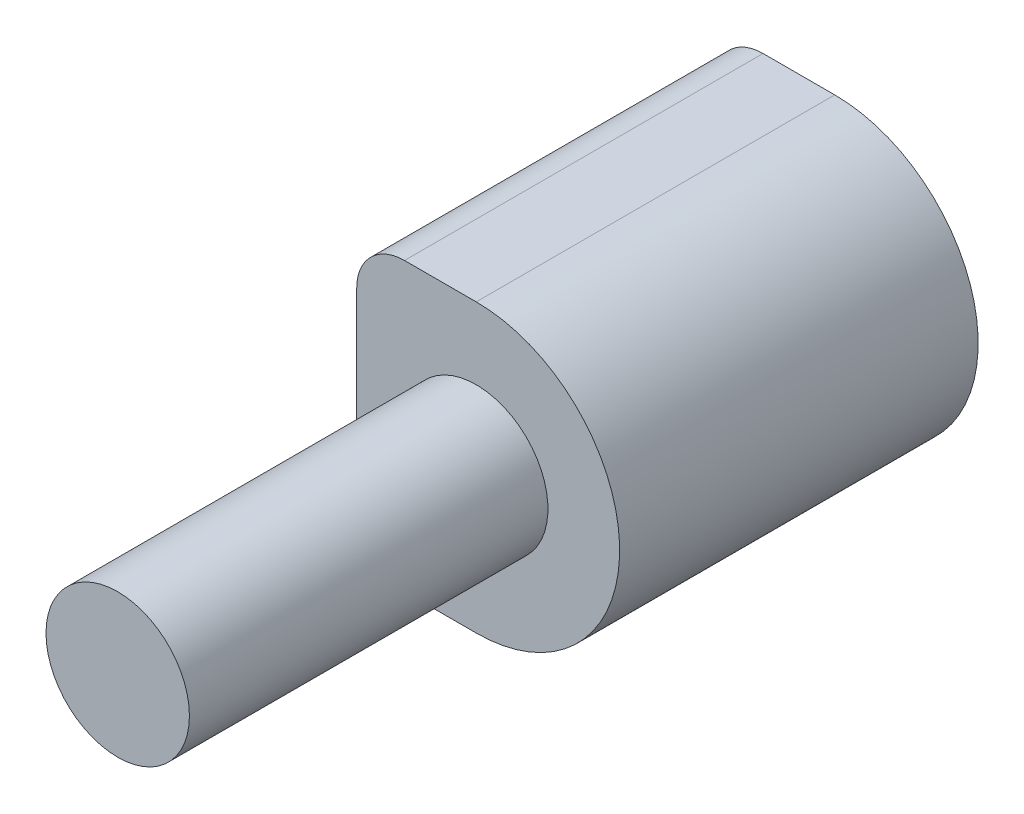
ISO-10303-21;
HEADER;
FILE_DESCRIPTION(('STEP AP214'),'2;1');
FILE_NAME('part.step','',(''),(''),'','','');
FILE_SCHEMA(('AUTOMOTIVE_DESIGN { 1 0 10303 214 1 1 1 1 }'));
ENDSEC;
DATA;
#1=APPLICATION_CONTEXT('core data for automotive mechanical design processes');
#2=APPLICATION_PROTOCOL_DEFINITION('international standard','automotive_design',2000,#1);
#3=PRODUCT_CONTEXT('',#1,'mechanical');
#4=PRODUCT('Part','Part','',(#3));
#5=PRODUCT_RELATED_PRODUCT_CATEGORY('part','',(#4));
#6=PRODUCT_DEFINITION_FORMATION('','',#4);
#7=PRODUCT_DEFINITION_CONTEXT('part definition',#1,'design');
#8=PRODUCT_DEFINITION('design','',#6,#7);
#9=PRODUCT_DEFINITION_SHAPE('','',#8);
#10=(LENGTH_UNIT() NAMED_UNIT(*) SI_UNIT(.MILLI.,.METRE.));
#11=(NAMED_UNIT(*) PLANE_ANGLE_UNIT() SI_UNIT($,.RADIAN.));
#12=(NAMED_UNIT(*) SI_UNIT($,.STERADIAN.) SOLID_ANGLE_UNIT());
#13=UNCERTAINTY_MEASURE_WITH_UNIT(LENGTH_MEASURE(1.E-05),#10,'distance_accuracy_value','');
#14=(GEOMETRIC_REPRESENTATION_CONTEXT(3) GLOBAL_UNCERTAINTY_ASSIGNED_CONTEXT((#13)) GLOBAL_UNIT_ASSIGNED_CONTEXT((#10,
#11,#12)) REPRESENTATION_CONTEXT('',''));
#15=CARTESIAN_POINT('',(0.,0.,0.));
#16=DIRECTION('',(0.,0.,1.));
#17=DIRECTION('',(1.,0.,0.));
#18=AXIS2_PLACEMENT_3D('',#15,#16,#17);
#19=CARTESIAN_POINT('',(15.,3.,30.));
#20=DIRECTION('',(0.,0.,1.));
#21=DIRECTION('',(1.,0.,0.));
#22=AXIS2_PLACEMENT_3D('',#19,#20,#21);
#23=PLANE('',#22);
#24=CARTESIAN_POINT('',(15.,3.,30.));
#25=DIRECTION('',(0.,0.,1.));
#26=DIRECTION('',(1.,0.,0.));
#27=AXIS2_PLACEMENT_3D('',#24,#25,#26);
#28=CIRCLE('',#27,3.);
#29=CARTESIAN_POINT('',(18.,3.,30.));
#30=VERTEX_POINT('',#29);
#31=EDGE_CURVE('E144',#30,#30,#28,.T.);
#32=ORIENTED_EDGE('',*,*,#31,.T.);
#33=EDGE_LOOP('',(#32));
#34=FACE_BOUND('',#33,.T.);
#35=ADVANCED_FACE('F34',(#34),#23,.T.);
#36=CARTESIAN_POINT('',(19.,0.,0.));
#37=DIRECTION('',(-1.,0.,0.));
#38=DIRECTION('',(0.,0.,1.));
#39=AXIS2_PLACEMENT_3D('',#36,#37,#38);
#40=PLANE('',#39);
#41=DIRECTION('',(0.,1.,0.));
#42=VECTOR('',#41,1.);
#43=CARTESIAN_POINT('',(19.,5.,13.5));
#44=LINE('',#43,#42);
#45=CARTESIAN_POINT('',(19.,1.,13.5));
#46=VERTEX_POINT('',#45);
#47=CARTESIAN_POINT('',(19.,5.,13.5));
#48=VERTEX_POINT('',#47);
#49=EDGE_CURVE('E111',#46,#48,#44,.T.);
#50=ORIENTED_EDGE('',*,*,#49,.T.);
#51=DIRECTION('',(0.,0.,-1.));
#52=VECTOR('',#51,1.);
#53=CARTESIAN_POINT('',(19.,5.,1.5));
#54=LINE('',#53,#52);
#55=CARTESIAN_POINT('',(19.,5.,1.5));
#56=VERTEX_POINT('',#55);
#57=EDGE_CURVE('E120',#48,#56,#54,.T.);
#58=ORIENTED_EDGE('',*,*,#57,.T.);
#59=DIRECTION('',(0.,-1.,0.));
#60=VECTOR('',#59,1.);
#61=CARTESIAN_POINT('',(19.,5.,1.5));
#62=LINE('',#61,#60);
#63=CARTESIAN_POINT('',(19.,1.,1.5));
#64=VERTEX_POINT('',#63);
#65=EDGE_CURVE('E125',#56,#64,#62,.T.);
#66=ORIENTED_EDGE('',*,*,#65,.T.);
#67=DIRECTION('',(0.,0.,1.));
#68=VECTOR('',#67,1.);
#69=CARTESIAN_POINT('',(19.,1.,1.5));
#70=LINE('',#69,#68);
#71=EDGE_CURVE('E117',#64,#46,#70,.T.);
#72=ORIENTED_EDGE('',*,*,#71,.T.);
#73=EDGE_LOOP('',(#50,#58,#66,#72));
#74=FACE_BOUND('',#73,.T.);
#75=ADVANCED_FACE('F127',(#74),#40,.T.);
#76=CARTESIAN_POINT('',(15.,3.,30.));
#77=DIRECTION('',(0.,0.,-1.));
#78=DIRECTION('',(-1.,0.,0.));
#79=AXIS2_PLACEMENT_3D('',#76,#77,#78);
#80=CYLINDRICAL_SURFACE('',#79,3.);
#81=ORIENTED_EDGE('',*,*,#31,.F.);
#82=EDGE_LOOP('',(#81));
#83=FACE_BOUND('',#82,.T.);
#84=CARTESIAN_POINT('',(15.,3.,15.));
#85=DIRECTION('',(0.,0.,-1.));
#86=DIRECTION('',(-1.,0.,0.));
#87=AXIS2_PLACEMENT_3D('',#84,#85,#86);
#88=CIRCLE('',#87,3.);
#89=CARTESIAN_POINT('',(12.,3.,15.));
#90=VERTEX_POINT('',#89);
#91=EDGE_CURVE('E175',#90,#90,#88,.F.);
#92=ORIENTED_EDGE('',*,*,#91,.T.);
#93=EDGE_LOOP('',(#92));
#94=FACE_BOUND('',#93,.T.);
#95=ADVANCED_FACE('F251',(#83,#94),#80,.T.);
#96=CARTESIAN_POINT('',(19.,5.,1.5));
#97=DIRECTION('',(0.,0.,-1.));
#98=DIRECTION('',(-1.,0.,0.));
#99=AXIS2_PLACEMENT_3D('',#96,#97,#98);
#100=PLANE('',#99);
#101=DIRECTION('',(0.,-1.,0.));
#102=VECTOR('',#101,1.);
#103=CARTESIAN_POINT('',(10.,5.,1.5));
#104=LINE('',#103,#102);
#105=CARTESIAN_POINT('',(10.,5.,1.5));
#106=VERTEX_POINT('',#105);
#107=CARTESIAN_POINT('',(10.,1.,1.5));
#108=VERTEX_POINT('',#107);
#109=EDGE_CURVE('E132',#106,#108,#104,.T.);
#110=ORIENTED_EDGE('',*,*,#109,.T.);
#111=DIRECTION('',(-1.,0.,0.));
#112=VECTOR('',#111,1.);
#113=CARTESIAN_POINT('',(19.,1.,1.5));
#114=LINE('',#113,#112);
#115=EDGE_CURVE('E145',#64,#108,#114,.T.);
#116=ORIENTED_EDGE('',*,*,#115,.F.);
#117=ORIENTED_EDGE('',*,*,#65,.F.);
#118=DIRECTION('',(-1.,0.,0.));
#119=VECTOR('',#118,1.);
#120=CARTESIAN_POINT('',(19.,5.,1.5));
#121=LINE('',#120,#119);
#122=EDGE_CURVE('E116',#56,#106,#121,.T.);
#123=ORIENTED_EDGE('',*,*,#122,.T.);
#124=EDGE_LOOP('',(#110,#116,#117,#123));
#125=FACE_BOUND('',#124,.T.);
#126=ADVANCED_FACE('F254',(#125),#100,.F.);
#127=CARTESIAN_POINT('',(19.,1.,1.5));
#128=DIRECTION('',(0.,-1.,0.));
#129=DIRECTION('',(0.,0.,-1.));
#130=AXIS2_PLACEMENT_3D('',#127,#128,#129);
#131=PLANE('',#130);
#132=DIRECTION('',(0.,0.,1.));
#133=VECTOR('',#132,1.);
#134=CARTESIAN_POINT('',(10.,1.,1.5));
#135=LINE('',#134,#133);
#136=CARTESIAN_POINT('',(10.,1.,13.5));
#137=VERTEX_POINT('',#136);
#138=EDGE_CURVE('E129',#108,#137,#135,.T.);
#139=ORIENTED_EDGE('',*,*,#138,.T.);
#140=DIRECTION('',(-1.,0.,0.));
#141=VECTOR('',#140,1.);
#142=CARTESIAN_POINT('',(19.,1.,13.5));
#143=LINE('',#142,#141);
#144=EDGE_CURVE('E142',#46,#137,#143,.T.);
#145=ORIENTED_EDGE('',*,*,#144,.F.);
#146=ORIENTED_EDGE('',*,*,#71,.F.);
#147=ORIENTED_EDGE('',*,*,#115,.T.);
#148=EDGE_LOOP('',(#139,#145,#146,#147));
#149=FACE_BOUND('',#148,.T.);
#150=ADVANCED_FACE('F261',(#149),#131,.F.);
#151=CARTESIAN_POINT('',(19.,5.,13.5));
#152=DIRECTION('',(0.,0.,1.));
#153=DIRECTION('',(1.,0.,0.));
#154=AXIS2_PLACEMENT_3D('',#151,#152,#153);
#155=PLANE('',#154);
#156=DIRECTION('',(0.,1.,0.));
#157=VECTOR('',#156,1.);
#158=CARTESIAN_POINT('',(10.,5.,13.5));
#159=LINE('',#158,#157);
#160=CARTESIAN_POINT('',(10.,5.,13.5));
#161=VERTEX_POINT('',#160);
#162=EDGE_CURVE('E49',#137,#161,#159,.T.);
#163=ORIENTED_EDGE('',*,*,#162,.T.);
#164=DIRECTION('',(-1.,0.,0.));
#165=VECTOR('',#164,1.);
#166=CARTESIAN_POINT('',(19.,5.,13.5));
#167=LINE('',#166,#165);
#168=EDGE_CURVE('E107',#48,#161,#167,.T.);
#169=ORIENTED_EDGE('',*,*,#168,.F.);
#170=ORIENTED_EDGE('',*,*,#49,.F.);
#171=ORIENTED_EDGE('',*,*,#144,.T.);
#172=EDGE_LOOP('',(#163,#169,#170,#171));
#173=FACE_BOUND('',#172,.T.);
#174=ADVANCED_FACE('F109',(#173),#155,.F.);
#175=CARTESIAN_POINT('',(19.,5.,1.5));
#176=DIRECTION('',(0.,1.,0.));
#177=DIRECTION('',(0.,0.,1.));
#178=AXIS2_PLACEMENT_3D('',#175,#176,#177);
#179=PLANE('',#178);
#180=DIRECTION('',(0.,0.,-1.));
#181=VECTOR('',#180,1.);
#182=CARTESIAN_POINT('',(10.,5.,1.5));
#183=LINE('',#182,#181);
#184=EDGE_CURVE('E138',#161,#106,#183,.T.);
#185=ORIENTED_EDGE('',*,*,#184,.T.);
#186=ORIENTED_EDGE('',*,*,#122,.F.);
#187=ORIENTED_EDGE('',*,*,#57,.F.);
#188=ORIENTED_EDGE('',*,*,#168,.T.);
#189=EDGE_LOOP('',(#185,#186,#187,#188));
#190=FACE_BOUND('',#189,.T.);
#191=ADVANCED_FACE('F121',(#190),#179,.F.);
#192=CARTESIAN_POINT('',(10.,-3.,15.));
#193=DIRECTION('',(0.,1.,0.));
#194=DIRECTION('',(-1.,0.,0.));
#195=AXIS2_PLACEMENT_3D('',#192,#193,#194);
#196=PLANE('',#195);
#197=DIRECTION('',(1.,0.,0.));
#198=VECTOR('',#197,1.);
#199=CARTESIAN_POINT('',(10.,-3.,15.));
#200=LINE('',#199,#198);
#201=CARTESIAN_POINT('',(12.,-3.,15.));
#202=VERTEX_POINT('',#201);
#203=CARTESIAN_POINT('',(15.,-3.,15.));
#204=VERTEX_POINT('',#203);
#205=EDGE_CURVE('E157',#202,#204,#200,.T.);
#206=ORIENTED_EDGE('',*,*,#205,.F.);
#207=DIRECTION('',(0.,0.,-1.));
#208=VECTOR('',#207,1.);
#209=CARTESIAN_POINT('',(12.,-3.,15.));
#210=LINE('',#209,#208);
#211=CARTESIAN_POINT('',(12.,-3.,0.));
#212=VERTEX_POINT('',#211);
#213=EDGE_CURVE('E184',#202,#212,#210,.T.);
#214=ORIENTED_EDGE('',*,*,#213,.T.);
#215=DIRECTION('',(1.,0.,0.));
#216=VECTOR('',#215,1.);
#217=CARTESIAN_POINT('',(10.,-3.,0.));
#218=LINE('',#217,#216);
#219=CARTESIAN_POINT('',(15.,-3.,0.));
#220=VERTEX_POINT('',#219);
#221=EDGE_CURVE('E167',#212,#220,#218,.T.);
#222=ORIENTED_EDGE('',*,*,#221,.T.);
#223=DIRECTION('',(0.,0.,-1.));
#224=VECTOR('',#223,1.);
#225=CARTESIAN_POINT('',(15.,-3.,15.));
#226=LINE('',#225,#224);
#227=EDGE_CURVE('E178',#204,#220,#226,.T.);
#228=ORIENTED_EDGE('',*,*,#227,.F.);
#229=EDGE_LOOP('',(#206,#214,#222,#228));
#230=FACE_BOUND('',#229,.T.);
#231=ADVANCED_FACE('F199',(#230),#196,.F.);
#232=CARTESIAN_POINT('',(10.,9.,15.));
#233=DIRECTION('',(1.,0.,0.));
#234=DIRECTION('',(0.,0.,-1.));
#235=AXIS2_PLACEMENT_3D('',#232,#233,#234);
#236=PLANE('',#235);
#237=ORIENTED_EDGE('',*,*,#184,.F.);
#238=ORIENTED_EDGE('',*,*,#162,.F.);
#239=ORIENTED_EDGE('',*,*,#138,.F.);
#240=ORIENTED_EDGE('',*,*,#109,.F.);
#241=EDGE_LOOP('',(#237,#238,#239,#240));
#242=FACE_BOUND('',#241,.T.);
#243=DIRECTION('',(0.,-1.,0.));
#244=VECTOR('',#243,1.);
#245=CARTESIAN_POINT('',(10.,9.,0.));
#246=LINE('',#245,#244);
#247=CARTESIAN_POINT('',(10.,7.,0.));
#248=VERTEX_POINT('',#247);
#249=CARTESIAN_POINT('',(10.,-0.999999999999999,0.));
#250=VERTEX_POINT('',#249);
#251=EDGE_CURVE('E154',#248,#250,#246,.T.);
#252=ORIENTED_EDGE('',*,*,#251,.T.);
#253=DIRECTION('',(0.,0.,-1.));
#254=VECTOR('',#253,1.);
#255=CARTESIAN_POINT('',(10.,-0.999999999999999,15.));
#256=LINE('',#255,#254);
#257=CARTESIAN_POINT('',(10.,-0.999999999999999,15.));
#258=VERTEX_POINT('',#257);
#259=EDGE_CURVE('E209',#250,#258,#256,.F.);
#260=ORIENTED_EDGE('',*,*,#259,.T.);
#261=DIRECTION('',(0.,-1.,0.));
#262=VECTOR('',#261,1.);
#263=CARTESIAN_POINT('',(10.,9.,15.));
#264=LINE('',#263,#262);
#265=CARTESIAN_POINT('',(10.,7.,15.));
#266=VERTEX_POINT('',#265);
#267=EDGE_CURVE('E159',#266,#258,#264,.T.);
#268=ORIENTED_EDGE('',*,*,#267,.F.);
#269=DIRECTION('',(0.,0.,-1.));
#270=VECTOR('',#269,1.);
#271=CARTESIAN_POINT('',(10.,7.,0.));
#272=LINE('',#271,#270);
#273=EDGE_CURVE('E204',#266,#248,#272,.T.);
#274=ORIENTED_EDGE('',*,*,#273,.T.);
#275=EDGE_LOOP('',(#252,#260,#268,#274));
#276=FACE_BOUND('',#275,.T.);
#277=ADVANCED_FACE('F222',(#242,#276),#236,.F.);
#278=CARTESIAN_POINT('',(10.,9.,15.));
#279=DIRECTION('',(0.,1.,0.));
#280=DIRECTION('',(-1.,0.,0.));
#281=AXIS2_PLACEMENT_3D('',#278,#279,#280);
#282=PLANE('',#281);
#283=DIRECTION('',(1.,0.,0.));
#284=VECTOR('',#283,1.);
#285=CARTESIAN_POINT('',(10.,9.,0.));
#286=LINE('',#285,#284);
#287=CARTESIAN_POINT('',(12.,9.,0.));
#288=VERTEX_POINT('',#287);
#289=CARTESIAN_POINT('',(15.,9.,0.));
#290=VERTEX_POINT('',#289);
#291=EDGE_CURVE('E150',#288,#290,#286,.T.);
#292=ORIENTED_EDGE('',*,*,#291,.F.);
#293=DIRECTION('',(0.,0.,-1.));
#294=VECTOR('',#293,1.);
#295=CARTESIAN_POINT('',(12.,9.,15.));
#296=LINE('',#295,#294);
#297=CARTESIAN_POINT('',(12.,9.,15.));
#298=VERTEX_POINT('',#297);
#299=EDGE_CURVE('E11',#288,#298,#296,.F.);
#300=ORIENTED_EDGE('',*,*,#299,.T.);
#301=DIRECTION('',(1.,0.,0.));
#302=VECTOR('',#301,1.);
#303=CARTESIAN_POINT('',(10.,9.,15.));
#304=LINE('',#303,#302);
#305=CARTESIAN_POINT('',(15.,9.,15.));
#306=VERTEX_POINT('',#305);
#307=EDGE_CURVE('E151',#298,#306,#304,.T.);
#308=ORIENTED_EDGE('',*,*,#307,.T.);
#309=DIRECTION('',(0.,0.,-1.));
#310=VECTOR('',#309,1.);
#311=CARTESIAN_POINT('',(15.,9.,15.));
#312=LINE('',#311,#310);
#313=EDGE_CURVE('E162',#306,#290,#312,.T.);
#314=ORIENTED_EDGE('',*,*,#313,.T.);
#315=EDGE_LOOP('',(#292,#300,#308,#314));
#316=FACE_BOUND('',#315,.T.);
#317=ADVANCED_FACE('F188',(#316),#282,.T.);
#318=CARTESIAN_POINT('',(15.,3.,15.));
#319=DIRECTION('',(0.,0.,-1.));
#320=DIRECTION('',(-1.,0.,0.));
#321=AXIS2_PLACEMENT_3D('',#318,#319,#320);
#322=PLANE('',#321);
#323=ORIENTED_EDGE('',*,*,#91,.F.);
#324=EDGE_LOOP('',(#323));
#325=FACE_BOUND('',#324,.T.);
#326=ORIENTED_EDGE('',*,*,#267,.T.);
#327=CARTESIAN_POINT('',(12.,-1.,15.));
#328=DIRECTION('',(0.,0.,-1.));
#329=DIRECTION('',(-1.,0.,0.));
#330=AXIS2_PLACEMENT_3D('',#327,#328,#329);
#331=CIRCLE('',#330,2.);
#332=EDGE_CURVE('E213',#258,#202,#331,.F.);
#333=ORIENTED_EDGE('',*,*,#332,.T.);
#334=ORIENTED_EDGE('',*,*,#205,.T.);
#335=CARTESIAN_POINT('',(15.,3.,15.));
#336=DIRECTION('',(0.,0.,-1.));
#337=DIRECTION('',(-1.,0.,0.));
#338=AXIS2_PLACEMENT_3D('',#335,#336,#337);
#339=CIRCLE('',#338,6.);
#340=EDGE_CURVE('E153',#306,#204,#339,.T.);
#341=ORIENTED_EDGE('',*,*,#340,.F.);
#342=ORIENTED_EDGE('',*,*,#307,.F.);
#343=CARTESIAN_POINT('',(12.,7.,15.));
#344=DIRECTION('',(0.,0.,-1.));
#345=DIRECTION('',(-1.,0.,0.));
#346=AXIS2_PLACEMENT_3D('',#343,#344,#345);
#347=CIRCLE('',#346,2.);
#348=EDGE_CURVE('E211',#298,#266,#347,.F.);
#349=ORIENTED_EDGE('',*,*,#348,.T.);
#350=EDGE_LOOP('',(#326,#333,#334,#341,#342,#349));
#351=FACE_BOUND('',#350,.T.);
#352=ADVANCED_FACE('F217',(#325,#351),#322,.F.);
#353=CARTESIAN_POINT('',(12.,7.,15.));
#354=DIRECTION('',(0.,0.,1.));
#355=DIRECTION('',(1.,0.,0.));
#356=AXIS2_PLACEMENT_3D('',#353,#354,#355);
#357=CYLINDRICAL_SURFACE('',#356,2.);
#358=ORIENTED_EDGE('',*,*,#348,.F.);
#359=ORIENTED_EDGE('',*,*,#299,.F.);
#360=CARTESIAN_POINT('',(12.,7.,0.));
#361=DIRECTION('',(0.,0.,-1.));
#362=DIRECTION('',(-1.,0.,0.));
#363=AXIS2_PLACEMENT_3D('',#360,#361,#362);
#364=CIRCLE('',#363,2.);
#365=EDGE_CURVE('E42',#248,#288,#364,.T.);
#366=ORIENTED_EDGE('',*,*,#365,.F.);
#367=ORIENTED_EDGE('',*,*,#273,.F.);
#368=EDGE_LOOP('',(#358,#359,#366,#367));
#369=FACE_BOUND('',#368,.T.);
#370=ADVANCED_FACE('F36',(#369),#357,.T.);
#371=CARTESIAN_POINT('',(12.,-1.,15.));
#372=DIRECTION('',(0.,0.,-1.));
#373=DIRECTION('',(-1.,0.,0.));
#374=AXIS2_PLACEMENT_3D('',#371,#372,#373);
#375=CYLINDRICAL_SURFACE('',#374,2.);
#376=ORIENTED_EDGE('',*,*,#332,.F.);
#377=ORIENTED_EDGE('',*,*,#259,.F.);
#378=CARTESIAN_POINT('',(12.,-1.,0.));
#379=DIRECTION('',(0.,0.,-1.));
#380=DIRECTION('',(-1.,0.,0.));
#381=AXIS2_PLACEMENT_3D('',#378,#379,#380);
#382=CIRCLE('',#381,2.);
#383=EDGE_CURVE('E203',#212,#250,#382,.T.);
#384=ORIENTED_EDGE('',*,*,#383,.F.);
#385=ORIENTED_EDGE('',*,*,#213,.F.);
#386=EDGE_LOOP('',(#376,#377,#384,#385));
#387=FACE_BOUND('',#386,.T.);
#388=ADVANCED_FACE('F220',(#387),#375,.T.);
#389=CARTESIAN_POINT('',(15.,3.,15.));
#390=DIRECTION('',(0.,0.,-1.));
#391=DIRECTION('',(-1.,0.,0.));
#392=AXIS2_PLACEMENT_3D('',#389,#390,#391);
#393=CYLINDRICAL_SURFACE('',#392,6.);
#394=CARTESIAN_POINT('',(15.,3.,0.));
#395=DIRECTION('',(0.,0.,-1.));
#396=DIRECTION('',(-1.,0.,0.));
#397=AXIS2_PLACEMENT_3D('',#394,#395,#396);
#398=CIRCLE('',#397,6.);
#399=EDGE_CURVE('E164',#290,#220,#398,.T.);
#400=ORIENTED_EDGE('',*,*,#399,.F.);
#401=ORIENTED_EDGE('',*,*,#313,.F.);
#402=ORIENTED_EDGE('',*,*,#340,.T.);
#403=ORIENTED_EDGE('',*,*,#227,.T.);
#404=EDGE_LOOP('',(#400,#401,#402,#403));
#405=FACE_BOUND('',#404,.T.);
#406=ADVANCED_FACE('F192',(#405),#393,.T.);
#407=CARTESIAN_POINT('',(15.,3.,0.));
#408=DIRECTION('',(0.,0.,-1.));
#409=DIRECTION('',(-1.,0.,0.));
#410=AXIS2_PLACEMENT_3D('',#407,#408,#409);
#411=PLANE('',#410);
#412=ORIENTED_EDGE('',*,*,#399,.T.);
#413=ORIENTED_EDGE('',*,*,#221,.F.);
#414=ORIENTED_EDGE('',*,*,#383,.T.);
#415=ORIENTED_EDGE('',*,*,#251,.F.);
#416=ORIENTED_EDGE('',*,*,#365,.T.);
#417=ORIENTED_EDGE('',*,*,#291,.T.);
#418=EDGE_LOOP('',(#412,#413,#414,#415,#416,#417));
#419=FACE_BOUND('',#418,.T.);
#420=ADVANCED_FACE('F195',(#419),#411,.T.);
#421=CLOSED_SHELL('',(#35,#75,#95,#126,#150,#174,#191,#231,#277,#317,#352,#370,#388,#406,#420));
#422=MANIFOLD_SOLID_BREP('B2',#421);
#423=ADVANCED_BREP_SHAPE_REPRESENTATION('',(#18,#422),#14);
#424=SHAPE_DEFINITION_REPRESENTATION(#9,#423);
ENDSEC;
END-ISO-10303-21;
